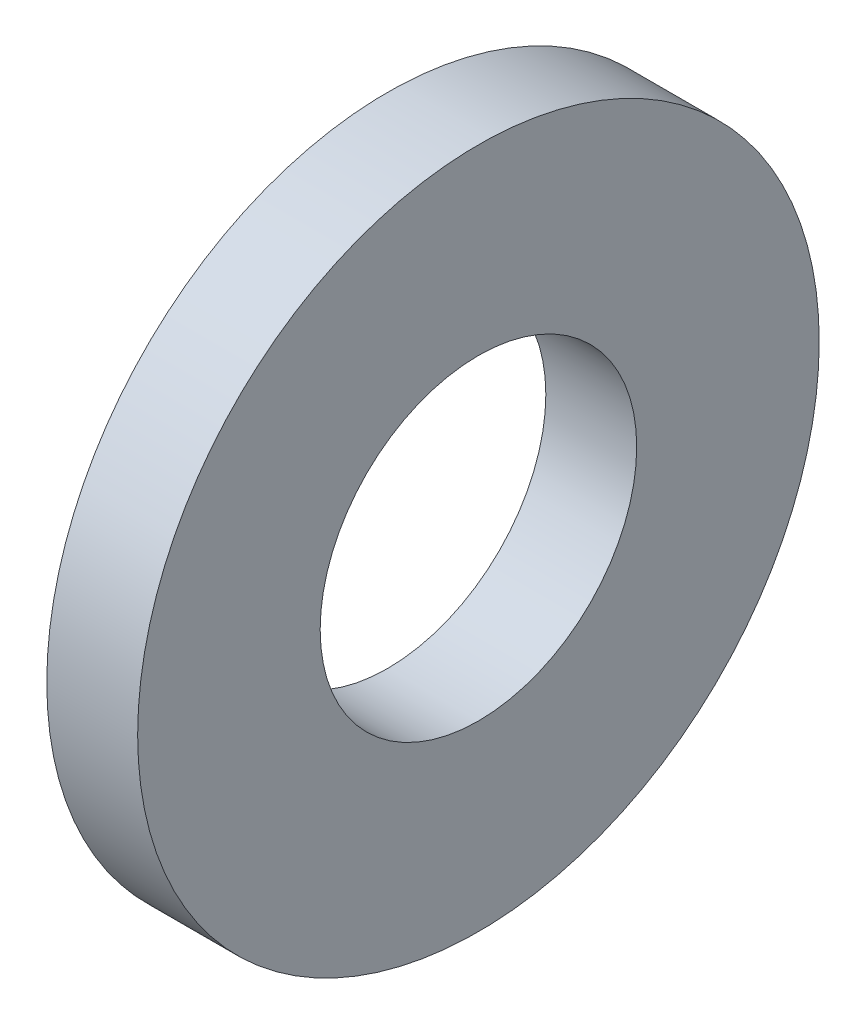
ISO-10303-21;
HEADER;
FILE_DESCRIPTION(('STEP AP214'),'2;1');
FILE_NAME('part.step','',(''),(''),'','','');
FILE_SCHEMA(('AUTOMOTIVE_DESIGN { 1 0 10303 214 1 1 1 1 }'));
ENDSEC;
DATA;
#1=APPLICATION_CONTEXT('core data for automotive mechanical design processes');
#2=APPLICATION_PROTOCOL_DEFINITION('international standard','automotive_design',2000,#1);
#3=PRODUCT_CONTEXT('',#1,'mechanical');
#4=PRODUCT('Part','Part','',(#3));
#5=PRODUCT_RELATED_PRODUCT_CATEGORY('part','',(#4));
#6=PRODUCT_DEFINITION_FORMATION('','',#4);
#7=PRODUCT_DEFINITION_CONTEXT('part definition',#1,'design');
#8=PRODUCT_DEFINITION('design','',#6,#7);
#9=PRODUCT_DEFINITION_SHAPE('','',#8);
#10=(LENGTH_UNIT() NAMED_UNIT(*) SI_UNIT(.MILLI.,.METRE.));
#11=(NAMED_UNIT(*) PLANE_ANGLE_UNIT() SI_UNIT($,.RADIAN.));
#12=(NAMED_UNIT(*) SI_UNIT($,.STERADIAN.) SOLID_ANGLE_UNIT());
#13=UNCERTAINTY_MEASURE_WITH_UNIT(LENGTH_MEASURE(1.E-05),#10,'distance_accuracy_value','');
#14=(GEOMETRIC_REPRESENTATION_CONTEXT(3) GLOBAL_UNCERTAINTY_ASSIGNED_CONTEXT((#13)) GLOBAL_UNIT_ASSIGNED_CONTEXT((#10,
#11,#12)) REPRESENTATION_CONTEXT('',''));
#15=CARTESIAN_POINT('',(0.,0.,0.));
#16=DIRECTION('',(0.,0.,1.));
#17=DIRECTION('',(1.,0.,0.));
#18=AXIS2_PLACEMENT_3D('',#15,#16,#17);
#19=CARTESIAN_POINT('',(-34.9249999999999,0.,0.));
#20=DIRECTION('',(-1.,0.,0.));
#21=DIRECTION('',(0.,0.,1.));
#22=AXIS2_PLACEMENT_3D('',#19,#20,#21);
#23=CYLINDRICAL_SURFACE('',#22,2.09);
#24=CARTESIAN_POINT('',(0.,0.,0.));
#25=DIRECTION('',(-1.,0.,0.));
#26=DIRECTION('',(0.,0.,1.));
#27=AXIS2_PLACEMENT_3D('',#24,#25,#26);
#28=CIRCLE('',#27,2.09);
#29=CARTESIAN_POINT('',(0.,0.,2.09));
#30=VERTEX_POINT('',#29);
#31=EDGE_CURVE('E10',#30,#30,#28,.T.);
#32=ORIENTED_EDGE('',*,*,#31,.F.);
#33=EDGE_LOOP('',(#32));
#34=FACE_BOUND('',#33,.T.);
#35=CARTESIAN_POINT('',(-1.2,0.,0.));
#36=DIRECTION('',(-1.,0.,0.));
#37=DIRECTION('',(0.,0.,1.));
#38=AXIS2_PLACEMENT_3D('',#35,#36,#37);
#39=CIRCLE('',#38,2.09);
#40=CARTESIAN_POINT('',(-1.2,0.,2.09));
#41=VERTEX_POINT('',#40);
#42=EDGE_CURVE('E45',#41,#41,#39,.T.);
#43=ORIENTED_EDGE('',*,*,#42,.T.);
#44=EDGE_LOOP('',(#43));
#45=FACE_BOUND('',#44,.T.);
#46=ADVANCED_FACE('F31',(#34,#45),#23,.F.);
#47=CARTESIAN_POINT('',(0.,2.09,0.));
#48=DIRECTION('',(-1.,0.,0.));
#49=DIRECTION('',(0.,0.,1.));
#50=AXIS2_PLACEMENT_3D('',#47,#48,#49);
#51=PLANE('',#50);
#52=CARTESIAN_POINT('',(0.,0.,0.));
#53=DIRECTION('',(-1.,0.,0.));
#54=DIRECTION('',(0.,0.,1.));
#55=AXIS2_PLACEMENT_3D('',#52,#53,#54);
#56=CIRCLE('',#55,4.5);
#57=CARTESIAN_POINT('',(0.,0.,4.5));
#58=VERTEX_POINT('',#57);
#59=EDGE_CURVE('E37',#58,#58,#56,.T.);
#60=ORIENTED_EDGE('',*,*,#59,.F.);
#61=EDGE_LOOP('',(#60));
#62=FACE_BOUND('',#61,.T.);
#63=ORIENTED_EDGE('',*,*,#31,.T.);
#64=EDGE_LOOP('',(#63));
#65=FACE_BOUND('',#64,.T.);
#66=ADVANCED_FACE('F60',(#62,#65),#51,.F.);
#67=CARTESIAN_POINT('',(-34.9249999999999,0.,0.));
#68=DIRECTION('',(-1.,0.,0.));
#69=DIRECTION('',(0.,0.,1.));
#70=AXIS2_PLACEMENT_3D('',#67,#68,#69);
#71=CYLINDRICAL_SURFACE('',#70,4.5);
#72=CARTESIAN_POINT('',(-1.2,0.,0.));
#73=DIRECTION('',(-1.,0.,0.));
#74=DIRECTION('',(0.,0.,1.));
#75=AXIS2_PLACEMENT_3D('',#72,#73,#74);
#76=CIRCLE('',#75,4.5);
#77=CARTESIAN_POINT('',(-1.2,0.,4.5));
#78=VERTEX_POINT('',#77);
#79=EDGE_CURVE('E41',#78,#78,#76,.T.);
#80=ORIENTED_EDGE('',*,*,#79,.F.);
#81=EDGE_LOOP('',(#80));
#82=FACE_BOUND('',#81,.T.);
#83=ORIENTED_EDGE('',*,*,#59,.T.);
#84=EDGE_LOOP('',(#83));
#85=FACE_BOUND('',#84,.T.);
#86=ADVANCED_FACE('F55',(#82,#85),#71,.T.);
#87=CARTESIAN_POINT('',(-1.2,4.5,0.));
#88=DIRECTION('',(1.,0.,0.));
#89=DIRECTION('',(0.,0.,-1.));
#90=AXIS2_PLACEMENT_3D('',#87,#88,#89);
#91=PLANE('',#90);
#92=ORIENTED_EDGE('',*,*,#42,.F.);
#93=EDGE_LOOP('',(#92));
#94=FACE_BOUND('',#93,.T.);
#95=ORIENTED_EDGE('',*,*,#79,.T.);
#96=EDGE_LOOP('',(#95));
#97=FACE_BOUND('',#96,.T.);
#98=ADVANCED_FACE('F52',(#94,#97),#91,.F.);
#99=CLOSED_SHELL('',(#46,#66,#86,#98));
#100=MANIFOLD_SOLID_BREP('B2',#99);
#101=ADVANCED_BREP_SHAPE_REPRESENTATION('',(#18,#100),#14);
#102=SHAPE_DEFINITION_REPRESENTATION(#9,#101);
ENDSEC;
END-ISO-10303-21;
